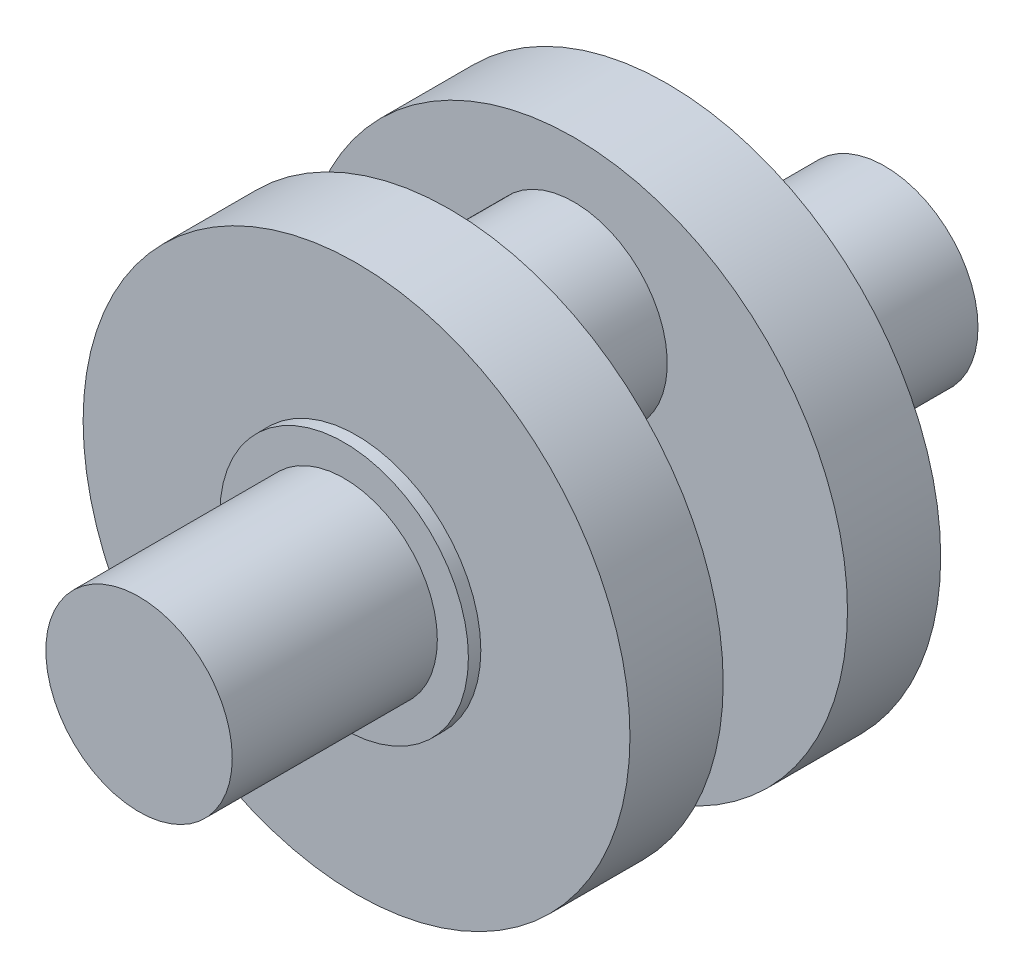
ISO-10303-21;
HEADER;
FILE_DESCRIPTION(('STEP AP214'),'2;1');
FILE_NAME('part.step','',(''),(''),'','','');
FILE_SCHEMA(('AUTOMOTIVE_DESIGN { 1 0 10303 214 1 1 1 1 }'));
ENDSEC;
DATA;
#1=APPLICATION_CONTEXT('core data for automotive mechanical design processes');
#2=APPLICATION_PROTOCOL_DEFINITION('international standard','automotive_design',2000,#1);
#3=PRODUCT_CONTEXT('',#1,'mechanical');
#4=PRODUCT('Part','Part','',(#3));
#5=PRODUCT_RELATED_PRODUCT_CATEGORY('part','',(#4));
#6=PRODUCT_DEFINITION_FORMATION('','',#4);
#7=PRODUCT_DEFINITION_CONTEXT('part definition',#1,'design');
#8=PRODUCT_DEFINITION('design','',#6,#7);
#9=PRODUCT_DEFINITION_SHAPE('','',#8);
#10=(LENGTH_UNIT() NAMED_UNIT(*) SI_UNIT(.MILLI.,.METRE.));
#11=(NAMED_UNIT(*) PLANE_ANGLE_UNIT() SI_UNIT($,.RADIAN.));
#12=(NAMED_UNIT(*) SI_UNIT($,.STERADIAN.) SOLID_ANGLE_UNIT());
#13=UNCERTAINTY_MEASURE_WITH_UNIT(LENGTH_MEASURE(1.E-05),#10,'distance_accuracy_value','');
#14=(GEOMETRIC_REPRESENTATION_CONTEXT(3) GLOBAL_UNCERTAINTY_ASSIGNED_CONTEXT((#13)) GLOBAL_UNIT_ASSIGNED_CONTEXT((#10,
#11,#12)) REPRESENTATION_CONTEXT('',''));
#15=CARTESIAN_POINT('',(0.,0.,0.));
#16=DIRECTION('',(0.,0.,1.));
#17=DIRECTION('',(1.,0.,0.));
#18=AXIS2_PLACEMENT_3D('',#15,#16,#17);
#19=CARTESIAN_POINT('',(0.,0.,33.));
#20=DIRECTION('',(0.,0.,-1.));
#21=DIRECTION('',(-1.,0.,0.));
#22=AXIS2_PLACEMENT_3D('',#19,#20,#21);
#23=CYLINDRICAL_SURFACE('',#22,15.);
#24=CARTESIAN_POINT('',(0.,0.,33.));
#25=DIRECTION('',(0.,0.,1.));
#26=DIRECTION('',(1.,0.,0.));
#27=AXIS2_PLACEMENT_3D('',#24,#25,#26);
#28=CIRCLE('',#27,15.);
#29=CARTESIAN_POINT('',(15.,0.,33.));
#30=VERTEX_POINT('',#29);
#31=EDGE_CURVE('E10',#30,#30,#28,.T.);
#32=ORIENTED_EDGE('',*,*,#31,.F.);
#33=EDGE_LOOP('',(#32));
#34=FACE_BOUND('',#33,.T.);
#35=CARTESIAN_POINT('',(0.,0.,0.));
#36=DIRECTION('',(0.,0.,1.));
#37=DIRECTION('',(1.,0.,0.));
#38=AXIS2_PLACEMENT_3D('',#35,#36,#37);
#39=CIRCLE('',#38,15.);
#40=CARTESIAN_POINT('',(15.,0.,0.));
#41=VERTEX_POINT('',#40);
#42=EDGE_CURVE('E40',#41,#41,#39,.T.);
#43=ORIENTED_EDGE('',*,*,#42,.T.);
#44=EDGE_LOOP('',(#43));
#45=FACE_BOUND('',#44,.T.);
#46=ADVANCED_FACE('F37',(#34,#45),#23,.T.);
#47=CARTESIAN_POINT('',(0.,0.,33.));
#48=DIRECTION('',(0.,0.,1.));
#49=DIRECTION('',(1.,0.,0.));
#50=AXIS2_PLACEMENT_3D('',#47,#48,#49);
#51=PLANE('',#50);
#52=ORIENTED_EDGE('',*,*,#31,.T.);
#53=EDGE_LOOP('',(#52));
#54=FACE_BOUND('',#53,.T.);
#55=ADVANCED_FACE('F120',(#54),#51,.T.);
#56=CARTESIAN_POINT('',(0.,0.,-2.));
#57=DIRECTION('',(0.,0.,1.));
#58=DIRECTION('',(1.,0.,0.));
#59=AXIS2_PLACEMENT_3D('',#56,#57,#58);
#60=CYLINDRICAL_SURFACE('',#59,20.);
#61=CARTESIAN_POINT('',(0.,0.,-2.));
#62=DIRECTION('',(0.,0.,-1.));
#63=DIRECTION('',(-1.,0.,0.));
#64=AXIS2_PLACEMENT_3D('',#61,#62,#63);
#65=CIRCLE('',#64,20.);
#66=CARTESIAN_POINT('',(-20.,0.,-2.));
#67=VERTEX_POINT('',#66);
#68=EDGE_CURVE('E49',#67,#67,#65,.T.);
#69=ORIENTED_EDGE('',*,*,#68,.F.);
#70=EDGE_LOOP('',(#69));
#71=FACE_BOUND('',#70,.T.);
#72=CARTESIAN_POINT('',(0.,0.,0.));
#73=DIRECTION('',(0.,0.,-1.));
#74=DIRECTION('',(-1.,0.,0.));
#75=AXIS2_PLACEMENT_3D('',#72,#73,#74);
#76=CIRCLE('',#75,20.);
#77=CARTESIAN_POINT('',(-20.,0.,0.));
#78=VERTEX_POINT('',#77);
#79=EDGE_CURVE('E51',#78,#78,#76,.T.);
#80=ORIENTED_EDGE('',*,*,#79,.T.);
#81=EDGE_LOOP('',(#80));
#82=FACE_BOUND('',#81,.T.);
#83=ADVANCED_FACE('F125',(#71,#82),#60,.T.);
#84=CARTESIAN_POINT('',(0.,0.,0.));
#85=DIRECTION('',(0.,0.,-1.));
#86=DIRECTION('',(-1.,0.,0.));
#87=AXIS2_PLACEMENT_3D('',#84,#85,#86);
#88=PLANE('',#87);
#89=ORIENTED_EDGE('',*,*,#42,.F.);
#90=EDGE_LOOP('',(#89));
#91=FACE_BOUND('',#90,.T.);
#92=ORIENTED_EDGE('',*,*,#79,.F.);
#93=EDGE_LOOP('',(#92));
#94=FACE_BOUND('',#93,.T.);
#95=ADVANCED_FACE('F129',(#91,#94),#88,.F.);
#96=CARTESIAN_POINT('',(0.,0.,-17.));
#97=DIRECTION('',(0.,0.,1.));
#98=DIRECTION('',(1.,0.,0.));
#99=AXIS2_PLACEMENT_3D('',#96,#97,#98);
#100=CYLINDRICAL_SURFACE('',#99,44.);
#101=CARTESIAN_POINT('',(0.,0.,-17.));
#102=DIRECTION('',(0.,0.,-1.));
#103=DIRECTION('',(-1.,0.,0.));
#104=AXIS2_PLACEMENT_3D('',#101,#102,#103);
#105=CIRCLE('',#104,44.);
#106=CARTESIAN_POINT('',(-44.,0.,-17.));
#107=VERTEX_POINT('',#106);
#108=EDGE_CURVE('E55',#107,#107,#105,.T.);
#109=ORIENTED_EDGE('',*,*,#108,.F.);
#110=EDGE_LOOP('',(#109));
#111=FACE_BOUND('',#110,.T.);
#112=CARTESIAN_POINT('',(0.,0.,-2.));
#113=DIRECTION('',(0.,0.,-1.));
#114=DIRECTION('',(-1.,0.,0.));
#115=AXIS2_PLACEMENT_3D('',#112,#113,#114);
#116=CIRCLE('',#115,44.);
#117=CARTESIAN_POINT('',(-44.,0.,-2.));
#118=VERTEX_POINT('',#117);
#119=EDGE_CURVE('E59',#118,#118,#116,.T.);
#120=ORIENTED_EDGE('',*,*,#119,.T.);
#121=EDGE_LOOP('',(#120));
#122=FACE_BOUND('',#121,.T.);
#123=ADVANCED_FACE('F132',(#111,#122),#100,.T.);
#124=CARTESIAN_POINT('',(0.,0.,-17.));
#125=DIRECTION('',(0.,0.,-1.));
#126=DIRECTION('',(-1.,0.,0.));
#127=AXIS2_PLACEMENT_3D('',#124,#125,#126);
#128=PLANE('',#127);
#129=CARTESIAN_POINT('',(0.,20.,-17.));
#130=DIRECTION('',(0.,0.,-1.));
#131=DIRECTION('',(-1.,0.,0.));
#132=AXIS2_PLACEMENT_3D('',#129,#130,#131);
#133=CIRCLE('',#132,15.);
#134=CARTESIAN_POINT('',(-15.,20.,-17.));
#135=VERTEX_POINT('',#134);
#136=EDGE_CURVE('E63',#135,#135,#133,.T.);
#137=ORIENTED_EDGE('',*,*,#136,.F.);
#138=EDGE_LOOP('',(#137));
#139=FACE_BOUND('',#138,.T.);
#140=ORIENTED_EDGE('',*,*,#108,.T.);
#141=EDGE_LOOP('',(#140));
#142=FACE_BOUND('',#141,.T.);
#143=ADVANCED_FACE('F115',(#139,#142),#128,.T.);
#144=CARTESIAN_POINT('',(0.,0.,-2.));
#145=DIRECTION('',(0.,0.,-1.));
#146=DIRECTION('',(-1.,0.,0.));
#147=AXIS2_PLACEMENT_3D('',#144,#145,#146);
#148=PLANE('',#147);
#149=ORIENTED_EDGE('',*,*,#68,.T.);
#150=EDGE_LOOP('',(#149));
#151=FACE_BOUND('',#150,.T.);
#152=ORIENTED_EDGE('',*,*,#119,.F.);
#153=EDGE_LOOP('',(#152));
#154=FACE_BOUND('',#153,.T.);
#155=ADVANCED_FACE('F105',(#151,#154),#148,.F.);
#156=CARTESIAN_POINT('',(0.,20.,-27.));
#157=DIRECTION('',(0.,0.,1.));
#158=DIRECTION('',(1.,0.,0.));
#159=AXIS2_PLACEMENT_3D('',#156,#157,#158);
#160=CYLINDRICAL_SURFACE('',#159,15.);
#161=ORIENTED_EDGE('',*,*,#136,.T.);
#162=EDGE_LOOP('',(#161));
#163=FACE_BOUND('',#162,.T.);
#164=CARTESIAN_POINT('',(0.,20.,-37.));
#165=DIRECTION('',(0.,0.,-1.));
#166=DIRECTION('',(-1.,0.,0.));
#167=AXIS2_PLACEMENT_3D('',#164,#165,#166);
#168=CIRCLE('',#167,15.);
#169=CARTESIAN_POINT('',(-15.,20.,-37.));
#170=VERTEX_POINT('',#169);
#171=EDGE_CURVE('E91',#170,#170,#168,.T.);
#172=ORIENTED_EDGE('',*,*,#171,.F.);
#173=EDGE_LOOP('',(#172));
#174=FACE_BOUND('',#173,.T.);
#175=ADVANCED_FACE('F102',(#163,#174),#160,.T.);
#176=CARTESIAN_POINT('',(0.,0.,-87.));
#177=DIRECTION('',(0.,0.,1.));
#178=DIRECTION('',(-1.,0.,0.));
#179=AXIS2_PLACEMENT_3D('',#176,#177,#178);
#180=CYLINDRICAL_SURFACE('',#179,15.);
#181=CARTESIAN_POINT('',(0.,0.,-87.));
#182=DIRECTION('',(0.,0.,1.));
#183=DIRECTION('',(1.,0.,0.));
#184=AXIS2_PLACEMENT_3D('',#181,#182,#183);
#185=CIRCLE('',#184,15.);
#186=CARTESIAN_POINT('',(15.,0.,-87.));
#187=VERTEX_POINT('',#186);
#188=EDGE_CURVE('E70',#187,#187,#185,.T.);
#189=ORIENTED_EDGE('',*,*,#188,.T.);
#190=EDGE_LOOP('',(#189));
#191=FACE_BOUND('',#190,.T.);
#192=CARTESIAN_POINT('',(0.,0.,-54.));
#193=DIRECTION('',(0.,0.,1.));
#194=DIRECTION('',(1.,0.,0.));
#195=AXIS2_PLACEMENT_3D('',#192,#193,#194);
#196=CIRCLE('',#195,15.);
#197=CARTESIAN_POINT('',(15.,0.,-54.));
#198=VERTEX_POINT('',#197);
#199=EDGE_CURVE('E71',#198,#198,#196,.T.);
#200=ORIENTED_EDGE('',*,*,#199,.F.);
#201=EDGE_LOOP('',(#200));
#202=FACE_BOUND('',#201,.T.);
#203=ADVANCED_FACE('F104',(#191,#202),#180,.T.);
#204=CARTESIAN_POINT('',(0.,0.,-87.));
#205=DIRECTION('',(0.,0.,-1.));
#206=DIRECTION('',(1.,0.,0.));
#207=AXIS2_PLACEMENT_3D('',#204,#205,#206);
#208=PLANE('',#207);
#209=ORIENTED_EDGE('',*,*,#188,.F.);
#210=EDGE_LOOP('',(#209));
#211=FACE_BOUND('',#210,.T.);
#212=ADVANCED_FACE('F112',(#211),#208,.T.);
#213=CARTESIAN_POINT('',(0.,0.,-52.));
#214=DIRECTION('',(0.,0.,-1.));
#215=DIRECTION('',(1.,0.,0.));
#216=AXIS2_PLACEMENT_3D('',#213,#214,#215);
#217=CYLINDRICAL_SURFACE('',#216,20.);
#218=CARTESIAN_POINT('',(0.,0.,-52.));
#219=DIRECTION('',(0.,0.,-1.));
#220=DIRECTION('',(-1.,0.,0.));
#221=AXIS2_PLACEMENT_3D('',#218,#219,#220);
#222=CIRCLE('',#221,20.);
#223=CARTESIAN_POINT('',(-20.,0.,-52.));
#224=VERTEX_POINT('',#223);
#225=EDGE_CURVE('E75',#224,#224,#222,.T.);
#226=ORIENTED_EDGE('',*,*,#225,.T.);
#227=EDGE_LOOP('',(#226));
#228=FACE_BOUND('',#227,.T.);
#229=CARTESIAN_POINT('',(0.,0.,-54.));
#230=DIRECTION('',(0.,0.,-1.));
#231=DIRECTION('',(-1.,0.,0.));
#232=AXIS2_PLACEMENT_3D('',#229,#230,#231);
#233=CIRCLE('',#232,20.);
#234=CARTESIAN_POINT('',(-20.,0.,-54.));
#235=VERTEX_POINT('',#234);
#236=EDGE_CURVE('E79',#235,#235,#233,.T.);
#237=ORIENTED_EDGE('',*,*,#236,.F.);
#238=EDGE_LOOP('',(#237));
#239=FACE_BOUND('',#238,.T.);
#240=ADVANCED_FACE('F207',(#228,#239),#217,.T.);
#241=CARTESIAN_POINT('',(0.,0.,-54.));
#242=DIRECTION('',(0.,0.,1.));
#243=DIRECTION('',(-1.,0.,0.));
#244=AXIS2_PLACEMENT_3D('',#241,#242,#243);
#245=PLANE('',#244);
#246=ORIENTED_EDGE('',*,*,#199,.T.);
#247=EDGE_LOOP('',(#246));
#248=FACE_BOUND('',#247,.T.);
#249=ORIENTED_EDGE('',*,*,#236,.T.);
#250=EDGE_LOOP('',(#249));
#251=FACE_BOUND('',#250,.T.);
#252=ADVANCED_FACE('F216',(#248,#251),#245,.F.);
#253=CARTESIAN_POINT('',(0.,0.,-37.));
#254=DIRECTION('',(0.,0.,-1.));
#255=DIRECTION('',(1.,0.,0.));
#256=AXIS2_PLACEMENT_3D('',#253,#254,#255);
#257=CYLINDRICAL_SURFACE('',#256,44.);
#258=CARTESIAN_POINT('',(0.,0.,-37.));
#259=DIRECTION('',(0.,0.,-1.));
#260=DIRECTION('',(-1.,0.,0.));
#261=AXIS2_PLACEMENT_3D('',#258,#259,#260);
#262=CIRCLE('',#261,44.);
#263=CARTESIAN_POINT('',(-44.,0.,-37.));
#264=VERTEX_POINT('',#263);
#265=EDGE_CURVE('E83',#264,#264,#262,.T.);
#266=ORIENTED_EDGE('',*,*,#265,.T.);
#267=EDGE_LOOP('',(#266));
#268=FACE_BOUND('',#267,.T.);
#269=CARTESIAN_POINT('',(0.,0.,-52.));
#270=DIRECTION('',(0.,0.,-1.));
#271=DIRECTION('',(-1.,0.,0.));
#272=AXIS2_PLACEMENT_3D('',#269,#270,#271);
#273=CIRCLE('',#272,44.);
#274=CARTESIAN_POINT('',(-44.,0.,-52.));
#275=VERTEX_POINT('',#274);
#276=EDGE_CURVE('E87',#275,#275,#273,.T.);
#277=ORIENTED_EDGE('',*,*,#276,.F.);
#278=EDGE_LOOP('',(#277));
#279=FACE_BOUND('',#278,.T.);
#280=ADVANCED_FACE('F225',(#268,#279),#257,.T.);
#281=CARTESIAN_POINT('',(0.,0.,-37.));
#282=DIRECTION('',(0.,0.,1.));
#283=DIRECTION('',(-1.,0.,0.));
#284=AXIS2_PLACEMENT_3D('',#281,#282,#283);
#285=PLANE('',#284);
#286=ORIENTED_EDGE('',*,*,#171,.T.);
#287=EDGE_LOOP('',(#286));
#288=FACE_BOUND('',#287,.T.);
#289=ORIENTED_EDGE('',*,*,#265,.F.);
#290=EDGE_LOOP('',(#289));
#291=FACE_BOUND('',#290,.T.);
#292=ADVANCED_FACE('F99',(#288,#291),#285,.T.);
#293=CARTESIAN_POINT('',(0.,0.,-52.));
#294=DIRECTION('',(0.,0.,1.));
#295=DIRECTION('',(-1.,0.,0.));
#296=AXIS2_PLACEMENT_3D('',#293,#294,#295);
#297=PLANE('',#296);
#298=ORIENTED_EDGE('',*,*,#225,.F.);
#299=EDGE_LOOP('',(#298));
#300=FACE_BOUND('',#299,.T.);
#301=ORIENTED_EDGE('',*,*,#276,.T.);
#302=EDGE_LOOP('',(#301));
#303=FACE_BOUND('',#302,.T.);
#304=ADVANCED_FACE('F242',(#300,#303),#297,.F.);
#305=CLOSED_SHELL('',(#46,#55,#83,#95,#123,#143,#155,#175,#203,#212,#240,#252,#280,#292,#304));
#306=MANIFOLD_SOLID_BREP('B2',#305);
#307=ADVANCED_BREP_SHAPE_REPRESENTATION('',(#18,#306),#14);
#308=SHAPE_DEFINITION_REPRESENTATION(#9,#307);
ENDSEC;
END-ISO-10303-21;
